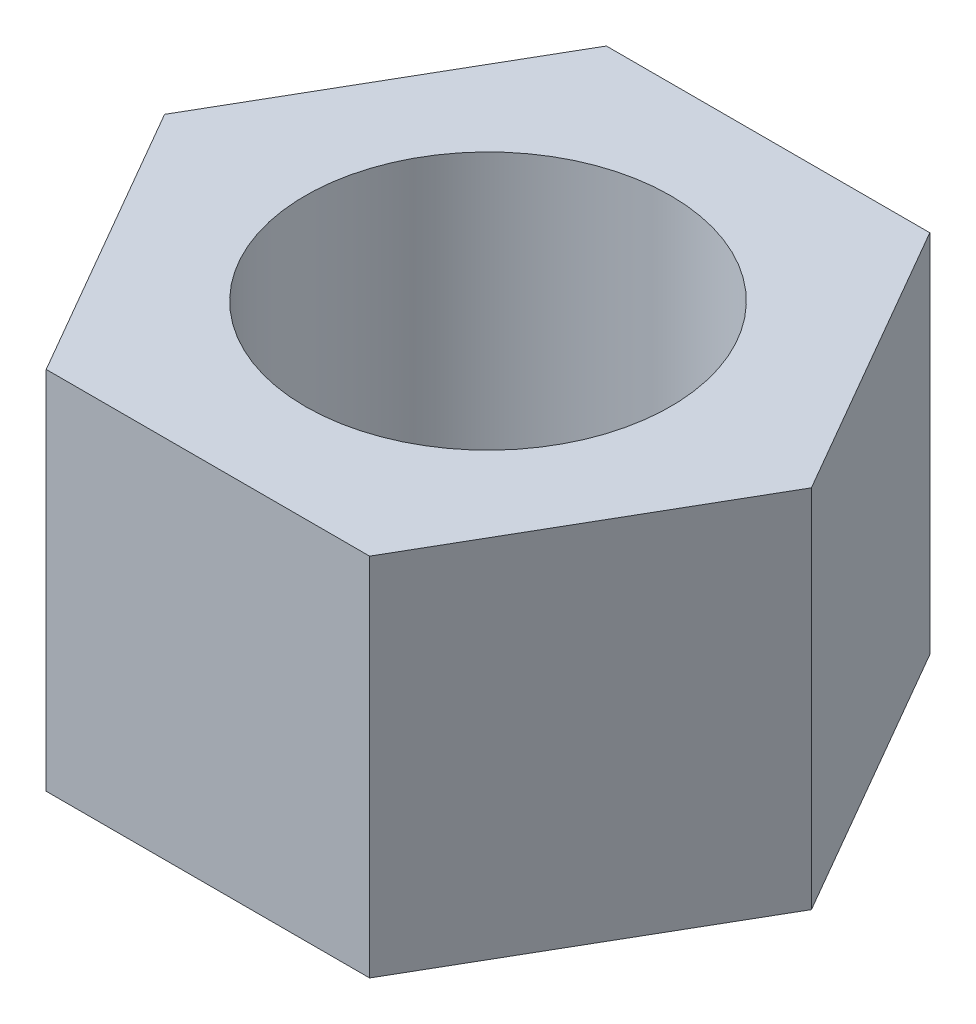
ISO-10303-21;
HEADER;
FILE_DESCRIPTION(('STEP AP214'),'2;1');
FILE_NAME('part.step','',(''),(''),'','','');
FILE_SCHEMA(('AUTOMOTIVE_DESIGN { 1 0 10303 214 1 1 1 1 }'));
ENDSEC;
DATA;
#1=APPLICATION_CONTEXT('core data for automotive mechanical design processes');
#2=APPLICATION_PROTOCOL_DEFINITION('international standard','automotive_design',2000,#1);
#3=PRODUCT_CONTEXT('',#1,'mechanical');
#4=PRODUCT('Part','Part','',(#3));
#5=PRODUCT_RELATED_PRODUCT_CATEGORY('part','',(#4));
#6=PRODUCT_DEFINITION_FORMATION('','',#4);
#7=PRODUCT_DEFINITION_CONTEXT('part definition',#1,'design');
#8=PRODUCT_DEFINITION('design','',#6,#7);
#9=PRODUCT_DEFINITION_SHAPE('','',#8);
#10=(LENGTH_UNIT() NAMED_UNIT(*) SI_UNIT(.MILLI.,.METRE.));
#11=(NAMED_UNIT(*) PLANE_ANGLE_UNIT() SI_UNIT($,.RADIAN.));
#12=(NAMED_UNIT(*) SI_UNIT($,.STERADIAN.) SOLID_ANGLE_UNIT());
#13=UNCERTAINTY_MEASURE_WITH_UNIT(LENGTH_MEASURE(1.E-05),#10,'distance_accuracy_value','');
#14=(GEOMETRIC_REPRESENTATION_CONTEXT(3) GLOBAL_UNCERTAINTY_ASSIGNED_CONTEXT((#13)) GLOBAL_UNIT_ASSIGNED_CONTEXT((#10,
#11,#12)) REPRESENTATION_CONTEXT('',''));
#15=CARTESIAN_POINT('',(0.,0.,0.));
#16=DIRECTION('',(0.,0.,1.));
#17=DIRECTION('',(1.,0.,0.));
#18=AXIS2_PLACEMENT_3D('',#15,#16,#17);
#19=CARTESIAN_POINT('',(-1.99185842870421,3.,1.15));
#20=DIRECTION('',(0.866025403784439,0.,-0.5));
#21=DIRECTION('',(-0.5,0.,-0.866025403784439));
#22=AXIS2_PLACEMENT_3D('',#19,#20,#21);
#23=PLANE('',#22);
#24=DIRECTION('',(0.5,0.,0.866025403784439));
#25=VECTOR('',#24,1.);
#26=CARTESIAN_POINT('',(-1.99185842870421,0.,1.15));
#27=LINE('',#26,#25);
#28=CARTESIAN_POINT('',(-2.65581123827228,0.,0.));
#29=VERTEX_POINT('',#28);
#30=CARTESIAN_POINT('',(-1.32790561913614,0.,2.3));
#31=VERTEX_POINT('',#30);
#32=EDGE_CURVE('E125',#29,#31,#27,.T.);
#33=ORIENTED_EDGE('',*,*,#32,.T.);
#34=DIRECTION('',(0.,-1.,0.));
#35=VECTOR('',#34,1.);
#36=CARTESIAN_POINT('',(-1.32790561913614,3.,2.3));
#37=LINE('',#36,#35);
#38=CARTESIAN_POINT('',(-1.32790561913614,3.,2.3));
#39=VERTEX_POINT('',#38);
#40=EDGE_CURVE('E11',#39,#31,#37,.T.);
#41=ORIENTED_EDGE('',*,*,#40,.F.);
#42=DIRECTION('',(0.5,0.,0.866025403784439));
#43=VECTOR('',#42,1.);
#44=CARTESIAN_POINT('',(-1.99185842870421,3.,1.15));
#45=LINE('',#44,#43);
#46=CARTESIAN_POINT('',(-2.65581123827228,3.,0.));
#47=VERTEX_POINT('',#46);
#48=EDGE_CURVE('E148',#47,#39,#45,.T.);
#49=ORIENTED_EDGE('',*,*,#48,.F.);
#50=DIRECTION('',(0.,-1.,0.));
#51=VECTOR('',#50,1.);
#52=CARTESIAN_POINT('',(-2.65581123827228,3.,0.));
#53=LINE('',#52,#51);
#54=EDGE_CURVE('E118',#47,#29,#53,.T.);
#55=ORIENTED_EDGE('',*,*,#54,.T.);
#56=EDGE_LOOP('',(#33,#41,#49,#55));
#57=FACE_BOUND('',#56,.T.);
#58=ADVANCED_FACE('F37',(#57),#23,.F.);
#59=CARTESIAN_POINT('',(0.,3.,2.3));
#60=DIRECTION('',(0.,0.,-1.));
#61=DIRECTION('',(-1.,0.,0.));
#62=AXIS2_PLACEMENT_3D('',#59,#60,#61);
#63=PLANE('',#62);
#64=DIRECTION('',(1.,0.,0.));
#65=VECTOR('',#64,1.);
#66=CARTESIAN_POINT('',(0.,0.,2.3));
#67=LINE('',#66,#65);
#68=CARTESIAN_POINT('',(1.32790561913614,0.,2.3));
#69=VERTEX_POINT('',#68);
#70=EDGE_CURVE('E128',#31,#69,#67,.T.);
#71=ORIENTED_EDGE('',*,*,#70,.T.);
#72=DIRECTION('',(0.,-1.,0.));
#73=VECTOR('',#72,1.);
#74=CARTESIAN_POINT('',(1.32790561913614,3.,2.3));
#75=LINE('',#74,#73);
#76=CARTESIAN_POINT('',(1.32790561913614,3.,2.3));
#77=VERTEX_POINT('',#76);
#78=EDGE_CURVE('E46',#77,#69,#75,.T.);
#79=ORIENTED_EDGE('',*,*,#78,.F.);
#80=DIRECTION('',(1.,0.,0.));
#81=VECTOR('',#80,1.);
#82=CARTESIAN_POINT('',(0.,3.,2.3));
#83=LINE('',#82,#81);
#84=EDGE_CURVE('E91',#39,#77,#83,.T.);
#85=ORIENTED_EDGE('',*,*,#84,.F.);
#86=ORIENTED_EDGE('',*,*,#40,.T.);
#87=EDGE_LOOP('',(#71,#79,#85,#86));
#88=FACE_BOUND('',#87,.T.);
#89=ADVANCED_FACE('F162',(#88),#63,.F.);
#90=CARTESIAN_POINT('',(1.99185842870421,3.,1.15));
#91=DIRECTION('',(-0.866025403784439,0.,-0.5));
#92=DIRECTION('',(-0.5,0.,0.866025403784439));
#93=AXIS2_PLACEMENT_3D('',#90,#91,#92);
#94=PLANE('',#93);
#95=DIRECTION('',(0.5,0.,-0.866025403784439));
#96=VECTOR('',#95,1.);
#97=CARTESIAN_POINT('',(1.99185842870421,0.,1.15));
#98=LINE('',#97,#96);
#99=CARTESIAN_POINT('',(2.65581123827228,0.,0.));
#100=VERTEX_POINT('',#99);
#101=EDGE_CURVE('E130',#69,#100,#98,.T.);
#102=ORIENTED_EDGE('',*,*,#101,.T.);
#103=DIRECTION('',(0.,-1.,0.));
#104=VECTOR('',#103,1.);
#105=CARTESIAN_POINT('',(2.65581123827228,3.,0.));
#106=LINE('',#105,#104);
#107=CARTESIAN_POINT('',(2.65581123827228,3.,0.));
#108=VERTEX_POINT('',#107);
#109=EDGE_CURVE('E113',#108,#100,#106,.T.);
#110=ORIENTED_EDGE('',*,*,#109,.F.);
#111=DIRECTION('',(0.5,0.,-0.866025403784439));
#112=VECTOR('',#111,1.);
#113=CARTESIAN_POINT('',(1.99185842870421,3.,1.15));
#114=LINE('',#113,#112);
#115=EDGE_CURVE('E104',#77,#108,#114,.T.);
#116=ORIENTED_EDGE('',*,*,#115,.F.);
#117=ORIENTED_EDGE('',*,*,#78,.T.);
#118=EDGE_LOOP('',(#102,#110,#116,#117));
#119=FACE_BOUND('',#118,.T.);
#120=ADVANCED_FACE('F141',(#119),#94,.F.);
#121=CARTESIAN_POINT('',(1.99185842870421,3.,-1.15));
#122=DIRECTION('',(-0.866025403784439,0.,0.5));
#123=DIRECTION('',(0.5,0.,0.866025403784439));
#124=AXIS2_PLACEMENT_3D('',#121,#122,#123);
#125=PLANE('',#124);
#126=DIRECTION('',(-0.5,0.,-0.866025403784439));
#127=VECTOR('',#126,1.);
#128=CARTESIAN_POINT('',(1.99185842870421,0.,-1.15));
#129=LINE('',#128,#127);
#130=CARTESIAN_POINT('',(1.32790561913614,0.,-2.3));
#131=VERTEX_POINT('',#130);
#132=EDGE_CURVE('E112',#100,#131,#129,.T.);
#133=ORIENTED_EDGE('',*,*,#132,.T.);
#134=DIRECTION('',(0.,-1.,0.));
#135=VECTOR('',#134,1.);
#136=CARTESIAN_POINT('',(1.32790561913614,3.,-2.3));
#137=LINE('',#136,#135);
#138=CARTESIAN_POINT('',(1.32790561913614,3.,-2.3));
#139=VERTEX_POINT('',#138);
#140=EDGE_CURVE('E109',#139,#131,#137,.T.);
#141=ORIENTED_EDGE('',*,*,#140,.F.);
#142=DIRECTION('',(-0.5,0.,-0.866025403784439));
#143=VECTOR('',#142,1.);
#144=CARTESIAN_POINT('',(1.99185842870421,3.,-1.15));
#145=LINE('',#144,#143);
#146=EDGE_CURVE('E98',#108,#139,#145,.T.);
#147=ORIENTED_EDGE('',*,*,#146,.F.);
#148=ORIENTED_EDGE('',*,*,#109,.T.);
#149=EDGE_LOOP('',(#133,#141,#147,#148));
#150=FACE_BOUND('',#149,.T.);
#151=ADVANCED_FACE('F110',(#150),#125,.F.);
#152=CARTESIAN_POINT('',(0.,3.,-2.3));
#153=DIRECTION('',(0.,0.,1.));
#154=DIRECTION('',(1.,0.,0.));
#155=AXIS2_PLACEMENT_3D('',#152,#153,#154);
#156=PLANE('',#155);
#157=DIRECTION('',(-1.,0.,0.));
#158=VECTOR('',#157,1.);
#159=CARTESIAN_POINT('',(0.,0.,-2.3));
#160=LINE('',#159,#158);
#161=CARTESIAN_POINT('',(-1.32790561913614,0.,-2.3));
#162=VERTEX_POINT('',#161);
#163=EDGE_CURVE('E77',#131,#162,#160,.T.);
#164=ORIENTED_EDGE('',*,*,#163,.T.);
#165=DIRECTION('',(0.,-1.,0.));
#166=VECTOR('',#165,1.);
#167=CARTESIAN_POINT('',(-1.32790561913614,3.,-2.3));
#168=LINE('',#167,#166);
#169=CARTESIAN_POINT('',(-1.32790561913614,3.,-2.3));
#170=VERTEX_POINT('',#169);
#171=EDGE_CURVE('E114',#170,#162,#168,.T.);
#172=ORIENTED_EDGE('',*,*,#171,.F.);
#173=DIRECTION('',(-1.,0.,0.));
#174=VECTOR('',#173,1.);
#175=CARTESIAN_POINT('',(0.,3.,-2.3));
#176=LINE('',#175,#174);
#177=EDGE_CURVE('E102',#139,#170,#176,.T.);
#178=ORIENTED_EDGE('',*,*,#177,.F.);
#179=ORIENTED_EDGE('',*,*,#140,.T.);
#180=EDGE_LOOP('',(#164,#172,#178,#179));
#181=FACE_BOUND('',#180,.T.);
#182=ADVANCED_FACE('F116',(#181),#156,.F.);
#183=CARTESIAN_POINT('',(0.,3.,0.));
#184=DIRECTION('',(0.,-1.,0.));
#185=DIRECTION('',(0.,0.,-1.));
#186=AXIS2_PLACEMENT_3D('',#183,#184,#185);
#187=CYLINDRICAL_SURFACE('',#186,1.5);
#188=CARTESIAN_POINT('',(0.,3.,0.));
#189=DIRECTION('',(0.,1.,0.));
#190=DIRECTION('',(0.,0.,1.));
#191=AXIS2_PLACEMENT_3D('',#188,#189,#190);
#192=CIRCLE('',#191,1.5);
#193=CARTESIAN_POINT('',(0.,3.,1.5));
#194=VERTEX_POINT('',#193);
#195=EDGE_CURVE('E135',#194,#194,#192,.T.);
#196=ORIENTED_EDGE('',*,*,#195,.T.);
#197=EDGE_LOOP('',(#196));
#198=FACE_BOUND('',#197,.T.);
#199=CARTESIAN_POINT('',(0.,0.,0.));
#200=DIRECTION('',(0.,1.,0.));
#201=DIRECTION('',(0.,0.,1.));
#202=AXIS2_PLACEMENT_3D('',#199,#200,#201);
#203=CIRCLE('',#202,1.5);
#204=CARTESIAN_POINT('',(0.,0.,1.5));
#205=VERTEX_POINT('',#204);
#206=EDGE_CURVE('E122',#205,#205,#203,.T.);
#207=ORIENTED_EDGE('',*,*,#206,.F.);
#208=EDGE_LOOP('',(#207));
#209=FACE_BOUND('',#208,.T.);
#210=ADVANCED_FACE('F39',(#198,#209),#187,.F.);
#211=CARTESIAN_POINT('',(-1.99185842870421,3.,-1.15));
#212=DIRECTION('',(0.866025403784439,0.,0.5));
#213=DIRECTION('',(0.5,0.,-0.866025403784439));
#214=AXIS2_PLACEMENT_3D('',#211,#212,#213);
#215=PLANE('',#214);
#216=DIRECTION('',(-0.5,0.,0.866025403784439));
#217=VECTOR('',#216,1.);
#218=CARTESIAN_POINT('',(-1.99185842870421,0.,-1.15));
#219=LINE('',#218,#217);
#220=EDGE_CURVE('E83',#162,#29,#219,.T.);
#221=ORIENTED_EDGE('',*,*,#220,.T.);
#222=ORIENTED_EDGE('',*,*,#54,.F.);
#223=DIRECTION('',(-0.5,0.,0.866025403784439));
#224=VECTOR('',#223,1.);
#225=CARTESIAN_POINT('',(-1.99185842870421,3.,-1.15));
#226=LINE('',#225,#224);
#227=EDGE_CURVE('E54',#170,#47,#226,.T.);
#228=ORIENTED_EDGE('',*,*,#227,.F.);
#229=ORIENTED_EDGE('',*,*,#171,.T.);
#230=EDGE_LOOP('',(#221,#222,#228,#229));
#231=FACE_BOUND('',#230,.T.);
#232=ADVANCED_FACE('F149',(#231),#215,.F.);
#233=CARTESIAN_POINT('',(0.,3.,0.));
#234=DIRECTION('',(0.,1.,0.));
#235=DIRECTION('',(0.,0.,1.));
#236=AXIS2_PLACEMENT_3D('',#233,#234,#235);
#237=PLANE('',#236);
#238=ORIENTED_EDGE('',*,*,#195,.F.);
#239=EDGE_LOOP('',(#238));
#240=FACE_BOUND('',#239,.T.);
#241=ORIENTED_EDGE('',*,*,#48,.T.);
#242=ORIENTED_EDGE('',*,*,#84,.T.);
#243=ORIENTED_EDGE('',*,*,#115,.T.);
#244=ORIENTED_EDGE('',*,*,#146,.T.);
#245=ORIENTED_EDGE('',*,*,#177,.T.);
#246=ORIENTED_EDGE('',*,*,#227,.T.);
#247=EDGE_LOOP('',(#241,#242,#243,#244,#245,#246));
#248=FACE_BOUND('',#247,.T.);
#249=ADVANCED_FACE('F100',(#240,#248),#237,.T.);
#250=CARTESIAN_POINT('',(0.,0.,0.));
#251=DIRECTION('',(0.,1.,0.));
#252=DIRECTION('',(0.,0.,1.));
#253=AXIS2_PLACEMENT_3D('',#250,#251,#252);
#254=PLANE('',#253);
#255=ORIENTED_EDGE('',*,*,#206,.T.);
#256=EDGE_LOOP('',(#255));
#257=FACE_BOUND('',#256,.T.);
#258=ORIENTED_EDGE('',*,*,#32,.F.);
#259=ORIENTED_EDGE('',*,*,#220,.F.);
#260=ORIENTED_EDGE('',*,*,#163,.F.);
#261=ORIENTED_EDGE('',*,*,#132,.F.);
#262=ORIENTED_EDGE('',*,*,#101,.F.);
#263=ORIENTED_EDGE('',*,*,#70,.F.);
#264=EDGE_LOOP('',(#258,#259,#260,#261,#262,#263));
#265=FACE_BOUND('',#264,.T.);
#266=ADVANCED_FACE('F144',(#257,#265),#254,.F.);
#267=CLOSED_SHELL('',(#58,#89,#120,#151,#182,#210,#232,#249,#266));
#268=MANIFOLD_SOLID_BREP('B2',#267);
#269=ADVANCED_BREP_SHAPE_REPRESENTATION('',(#18,#268),#14);
#270=SHAPE_DEFINITION_REPRESENTATION(#9,#269);
ENDSEC;
END-ISO-10303-21;
